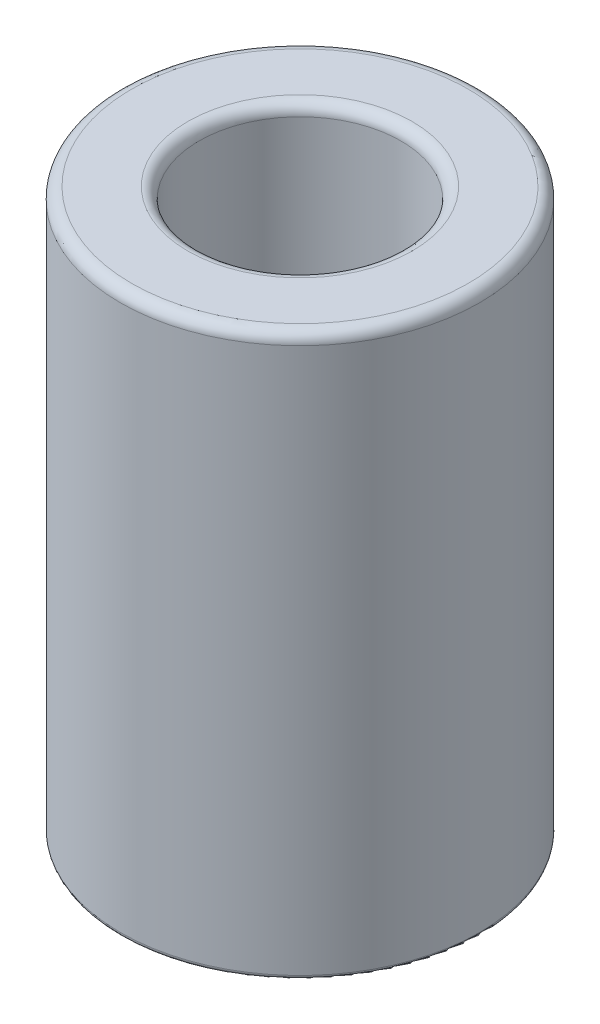
ISO-10303-21;
HEADER;
FILE_DESCRIPTION(('STEP AP214'),'2;1');
FILE_NAME('part.step','',(''),(''),'','','');
FILE_SCHEMA(('AUTOMOTIVE_DESIGN { 1 0 10303 214 1 1 1 1 }'));
ENDSEC;
DATA;
#1=APPLICATION_CONTEXT('core data for automotive mechanical design processes');
#2=APPLICATION_PROTOCOL_DEFINITION('international standard','automotive_design',2000,#1);
#3=PRODUCT_CONTEXT('',#1,'mechanical');
#4=PRODUCT('Part','Part','',(#3));
#5=PRODUCT_RELATED_PRODUCT_CATEGORY('part','',(#4));
#6=PRODUCT_DEFINITION_FORMATION('','',#4);
#7=PRODUCT_DEFINITION_CONTEXT('part definition',#1,'design');
#8=PRODUCT_DEFINITION('design','',#6,#7);
#9=PRODUCT_DEFINITION_SHAPE('','',#8);
#10=(LENGTH_UNIT() NAMED_UNIT(*) SI_UNIT(.MILLI.,.METRE.));
#11=(NAMED_UNIT(*) PLANE_ANGLE_UNIT() SI_UNIT($,.RADIAN.));
#12=(NAMED_UNIT(*) SI_UNIT($,.STERADIAN.) SOLID_ANGLE_UNIT());
#13=UNCERTAINTY_MEASURE_WITH_UNIT(LENGTH_MEASURE(1.E-05),#10,'distance_accuracy_value','');
#14=(GEOMETRIC_REPRESENTATION_CONTEXT(3) GLOBAL_UNCERTAINTY_ASSIGNED_CONTEXT((#13)) GLOBAL_UNIT_ASSIGNED_CONTEXT((#10,
#11,#12)) REPRESENTATION_CONTEXT('',''));
#15=CARTESIAN_POINT('',(0.,0.,0.));
#16=DIRECTION('',(0.,0.,1.));
#17=DIRECTION('',(1.,0.,0.));
#18=AXIS2_PLACEMENT_3D('',#15,#16,#17);
#19=CARTESIAN_POINT('',(0.,25.,0.));
#20=DIRECTION('',(0.,-1.,0.));
#21=DIRECTION('',(0.,0.,-1.));
#22=AXIS2_PLACEMENT_3D('',#19,#20,#21);
#23=CYLINDRICAL_SURFACE('',#22,7.99999999999999);
#24=CARTESIAN_POINT('',(0.,0.199999999999999,0.));
#25=DIRECTION('',(0.,1.,0.));
#26=DIRECTION('',(0.,0.,1.));
#27=AXIS2_PLACEMENT_3D('',#24,#25,#26);
#28=CIRCLE('',#27,7.99999999999999);
#29=CARTESIAN_POINT('',(0.,0.199999999999999,7.99999999999999));
#30=VERTEX_POINT('',#29);
#31=EDGE_CURVE('E43',#30,#30,#28,.T.);
#32=ORIENTED_EDGE('',*,*,#31,.T.);
#33=EDGE_LOOP('',(#32));
#34=FACE_BOUND('',#33,.T.);
#35=CARTESIAN_POINT('',(0.,24.5,0.));
#36=DIRECTION('',(0.,1.,0.));
#37=DIRECTION('',(0.,0.,1.));
#38=AXIS2_PLACEMENT_3D('',#35,#36,#37);
#39=CIRCLE('',#38,7.99999999999999);
#40=CARTESIAN_POINT('',(0.,24.5,7.99999999999999));
#41=VERTEX_POINT('',#40);
#42=EDGE_CURVE('E68',#41,#41,#39,.F.);
#43=ORIENTED_EDGE('',*,*,#42,.T.);
#44=EDGE_LOOP('',(#43));
#45=FACE_BOUND('',#44,.T.);
#46=ADVANCED_FACE('F36',(#34,#45),#23,.T.);
#47=CARTESIAN_POINT('',(0.,25.,0.));
#48=DIRECTION('',(0.,1.,0.));
#49=DIRECTION('',(0.,0.,1.));
#50=AXIS2_PLACEMENT_3D('',#47,#48,#49);
#51=PLANE('',#50);
#52=CARTESIAN_POINT('',(0.,25.,0.));
#53=DIRECTION('',(0.,1.,0.));
#54=DIRECTION('',(0.,0.,1.));
#55=AXIS2_PLACEMENT_3D('',#52,#53,#54);
#56=CIRCLE('',#55,5.);
#57=CARTESIAN_POINT('',(0.,25.,5.));
#58=VERTEX_POINT('',#57);
#59=EDGE_CURVE('E62',#58,#58,#56,.F.);
#60=ORIENTED_EDGE('',*,*,#59,.T.);
#61=EDGE_LOOP('',(#60));
#62=FACE_BOUND('',#61,.T.);
#63=CARTESIAN_POINT('',(0.,25.,0.));
#64=DIRECTION('',(0.,1.,0.));
#65=DIRECTION('',(0.,0.,1.));
#66=AXIS2_PLACEMENT_3D('',#63,#64,#65);
#67=CIRCLE('',#66,7.49999999999999);
#68=CARTESIAN_POINT('',(0.,25.,7.49999999999999));
#69=VERTEX_POINT('',#68);
#70=EDGE_CURVE('E71',#69,#69,#67,.T.);
#71=ORIENTED_EDGE('',*,*,#70,.T.);
#72=EDGE_LOOP('',(#71));
#73=FACE_BOUND('',#72,.T.);
#74=ADVANCED_FACE('F92',(#62,#73),#51,.T.);
#75=CARTESIAN_POINT('',(0.,0.,0.));
#76=DIRECTION('',(0.,1.,0.));
#77=DIRECTION('',(0.,0.,1.));
#78=AXIS2_PLACEMENT_3D('',#75,#76,#77);
#79=PLANE('',#78);
#80=CARTESIAN_POINT('',(0.,0.,0.));
#81=DIRECTION('',(0.,1.,0.));
#82=DIRECTION('',(0.,0.,1.));
#83=AXIS2_PLACEMENT_3D('',#80,#81,#82);
#84=CIRCLE('',#83,7.79999999999999);
#85=CARTESIAN_POINT('',(0.,0.,7.79999999999999));
#86=VERTEX_POINT('',#85);
#87=EDGE_CURVE('E10',#86,#86,#84,.F.);
#88=ORIENTED_EDGE('',*,*,#87,.T.);
#89=EDGE_LOOP('',(#88));
#90=FACE_BOUND('',#89,.T.);
#91=CARTESIAN_POINT('',(0.,0.,0.));
#92=DIRECTION('',(0.,1.,0.));
#93=DIRECTION('',(0.,0.,1.));
#94=AXIS2_PLACEMENT_3D('',#91,#92,#93);
#95=CIRCLE('',#94,2.99999999999999);
#96=CARTESIAN_POINT('',(0.,0.,2.99999999999999));
#97=VERTEX_POINT('',#96);
#98=EDGE_CURVE('E59',#97,#97,#95,.T.);
#99=ORIENTED_EDGE('',*,*,#98,.T.);
#100=EDGE_LOOP('',(#99));
#101=FACE_BOUND('',#100,.T.);
#102=ADVANCED_FACE('F82',(#90,#101),#79,.F.);
#103=CARTESIAN_POINT('',(0.,9.87,0.));
#104=DIRECTION('',(0.,1.,0.));
#105=DIRECTION('',(0.,0.,1.));
#106=AXIS2_PLACEMENT_3D('',#103,#104,#105);
#107=CYLINDRICAL_SURFACE('',#106,4.5);
#108=CARTESIAN_POINT('',(0.,24.5,0.));
#109=DIRECTION('',(0.,1.,0.));
#110=DIRECTION('',(0.,0.,1.));
#111=AXIS2_PLACEMENT_3D('',#108,#109,#110);
#112=CIRCLE('',#111,4.5);
#113=CARTESIAN_POINT('',(0.,24.5,4.5));
#114=VERTEX_POINT('',#113);
#115=EDGE_CURVE('E65',#114,#114,#112,.T.);
#116=ORIENTED_EDGE('',*,*,#115,.T.);
#117=EDGE_LOOP('',(#116));
#118=FACE_BOUND('',#117,.T.);
#119=CARTESIAN_POINT('',(0.,9.87,0.));
#120=DIRECTION('',(0.,1.,0.));
#121=DIRECTION('',(0.,0.,1.));
#122=AXIS2_PLACEMENT_3D('',#119,#120,#121);
#123=CIRCLE('',#122,4.5);
#124=CARTESIAN_POINT('',(0.,9.87,4.5));
#125=VERTEX_POINT('',#124);
#126=EDGE_CURVE('E74',#125,#125,#123,.T.);
#127=ORIENTED_EDGE('',*,*,#126,.F.);
#128=EDGE_LOOP('',(#127));
#129=FACE_BOUND('',#128,.T.);
#130=ADVANCED_FACE('F80',(#118,#129),#107,.F.);
#131=CARTESIAN_POINT('',(0.,9.87,0.));
#132=DIRECTION('',(0.,1.,0.));
#133=DIRECTION('',(0.,0.,1.));
#134=AXIS2_PLACEMENT_3D('',#131,#132,#133);
#135=PLANE('',#134);
#136=CARTESIAN_POINT('',(0.,9.87,0.));
#137=DIRECTION('',(0.,1.,0.));
#138=DIRECTION('',(0.,0.,1.));
#139=AXIS2_PLACEMENT_3D('',#136,#137,#138);
#140=CIRCLE('',#139,3.00000000000001);
#141=CARTESIAN_POINT('',(0.,9.87,3.00000000000001));
#142=VERTEX_POINT('',#141);
#143=EDGE_CURVE('E47',#142,#142,#140,.F.);
#144=ORIENTED_EDGE('',*,*,#143,.T.);
#145=EDGE_LOOP('',(#144));
#146=FACE_BOUND('',#145,.T.);
#147=ORIENTED_EDGE('',*,*,#126,.T.);
#148=EDGE_LOOP('',(#147));
#149=FACE_BOUND('',#148,.T.);
#150=ADVANCED_FACE('F78',(#146,#149),#135,.T.);
#151=CARTESIAN_POINT('',(0.,0.,0.));
#152=DIRECTION('',(0.,1.,0.));
#153=DIRECTION('',(0.,0.,1.));
#154=AXIS2_PLACEMENT_3D('',#151,#152,#153);
#155=CYLINDRICAL_SURFACE('',#154,2.5);
#156=CARTESIAN_POINT('',(0.,0.499999999999994,0.));
#157=DIRECTION('',(0.,1.,0.));
#158=DIRECTION('',(0.,0.,1.));
#159=AXIS2_PLACEMENT_3D('',#156,#157,#158);
#160=CIRCLE('',#159,2.5);
#161=CARTESIAN_POINT('',(0.,0.499999999999994,2.5));
#162=VERTEX_POINT('',#161);
#163=EDGE_CURVE('E51',#162,#162,#160,.F.);
#164=ORIENTED_EDGE('',*,*,#163,.T.);
#165=EDGE_LOOP('',(#164));
#166=FACE_BOUND('',#165,.T.);
#167=CARTESIAN_POINT('',(0.,9.37,0.));
#168=DIRECTION('',(0.,1.,0.));
#169=DIRECTION('',(0.,0.,1.));
#170=AXIS2_PLACEMENT_3D('',#167,#168,#169);
#171=CIRCLE('',#170,2.5);
#172=CARTESIAN_POINT('',(0.,9.37,2.5));
#173=VERTEX_POINT('',#172);
#174=EDGE_CURVE('E56',#173,#173,#171,.T.);
#175=ORIENTED_EDGE('',*,*,#174,.T.);
#176=EDGE_LOOP('',(#175));
#177=FACE_BOUND('',#176,.T.);
#178=ADVANCED_FACE('F89',(#166,#177),#155,.F.);
#179=CARTESIAN_POINT('',(0.,24.5,0.));
#180=DIRECTION('',(0.,1.,0.));
#181=DIRECTION('',(0.,0.,1.));
#182=AXIS2_PLACEMENT_3D('',#179,#180,#181);
#183=TOROIDAL_SURFACE('',#182,7.49999999999999,0.5);
#184=ORIENTED_EDGE('',*,*,#42,.F.);
#185=EDGE_LOOP('',(#184));
#186=FACE_BOUND('',#185,.T.);
#187=ORIENTED_EDGE('',*,*,#70,.F.);
#188=EDGE_LOOP('',(#187));
#189=FACE_BOUND('',#188,.T.);
#190=ADVANCED_FACE('F103',(#186,#189),#183,.T.);
#191=CARTESIAN_POINT('',(0.,24.5,0.));
#192=DIRECTION('',(0.,1.,0.));
#193=DIRECTION('',(0.,0.,1.));
#194=AXIS2_PLACEMENT_3D('',#191,#192,#193);
#195=TOROIDAL_SURFACE('',#194,5.,0.5);
#196=ORIENTED_EDGE('',*,*,#59,.F.);
#197=EDGE_LOOP('',(#196));
#198=FACE_BOUND('',#197,.T.);
#199=ORIENTED_EDGE('',*,*,#115,.F.);
#200=EDGE_LOOP('',(#199));
#201=FACE_BOUND('',#200,.T.);
#202=ADVANCED_FACE('F106',(#198,#201),#195,.T.);
#203=CARTESIAN_POINT('',(0.,0.,0.));
#204=DIRECTION('',(0.,-1.,0.));
#205=DIRECTION('',(0.,0.,-1.));
#206=AXIS2_PLACEMENT_3D('',#203,#204,#205);
#207=CONICAL_SURFACE('',#206,2.99999999999999,0.785398163397447);
#208=ORIENTED_EDGE('',*,*,#163,.F.);
#209=EDGE_LOOP('',(#208));
#210=FACE_BOUND('',#209,.T.);
#211=ORIENTED_EDGE('',*,*,#98,.F.);
#212=EDGE_LOOP('',(#211));
#213=FACE_BOUND('',#212,.T.);
#214=ADVANCED_FACE('F110',(#210,#213),#207,.F.);
#215=CARTESIAN_POINT('',(0.,9.37,0.));
#216=DIRECTION('',(0.,1.,0.));
#217=DIRECTION('',(0.,0.,1.));
#218=AXIS2_PLACEMENT_3D('',#215,#216,#217);
#219=CONICAL_SURFACE('',#218,2.5,0.785398163397454);
#220=ORIENTED_EDGE('',*,*,#143,.F.);
#221=EDGE_LOOP('',(#220));
#222=FACE_BOUND('',#221,.T.);
#223=ORIENTED_EDGE('',*,*,#174,.F.);
#224=EDGE_LOOP('',(#223));
#225=FACE_BOUND('',#224,.T.);
#226=ADVANCED_FACE('F117',(#222,#225),#219,.F.);
#227=CARTESIAN_POINT('',(0.,0.199999999999999,0.));
#228=DIRECTION('',(0.,1.,0.));
#229=DIRECTION('',(0.,0.,1.));
#230=AXIS2_PLACEMENT_3D('',#227,#228,#229);
#231=TOROIDAL_SURFACE('',#230,7.79999999999999,0.2);
#232=ORIENTED_EDGE('',*,*,#87,.F.);
#233=EDGE_LOOP('',(#232));
#234=FACE_BOUND('',#233,.T.);
#235=ORIENTED_EDGE('',*,*,#31,.F.);
#236=EDGE_LOOP('',(#235));
#237=FACE_BOUND('',#236,.T.);
#238=ADVANCED_FACE('F38',(#234,#237),#231,.T.);
#239=CLOSED_SHELL('',(#46,#74,#102,#130,#150,#178,#190,#202,#214,#226,#238));
#240=MANIFOLD_SOLID_BREP('B2',#239);
#241=ADVANCED_BREP_SHAPE_REPRESENTATION('',(#18,#240),#14);
#242=SHAPE_DEFINITION_REPRESENTATION(#9,#241);
ENDSEC;
END-ISO-10303-21;
